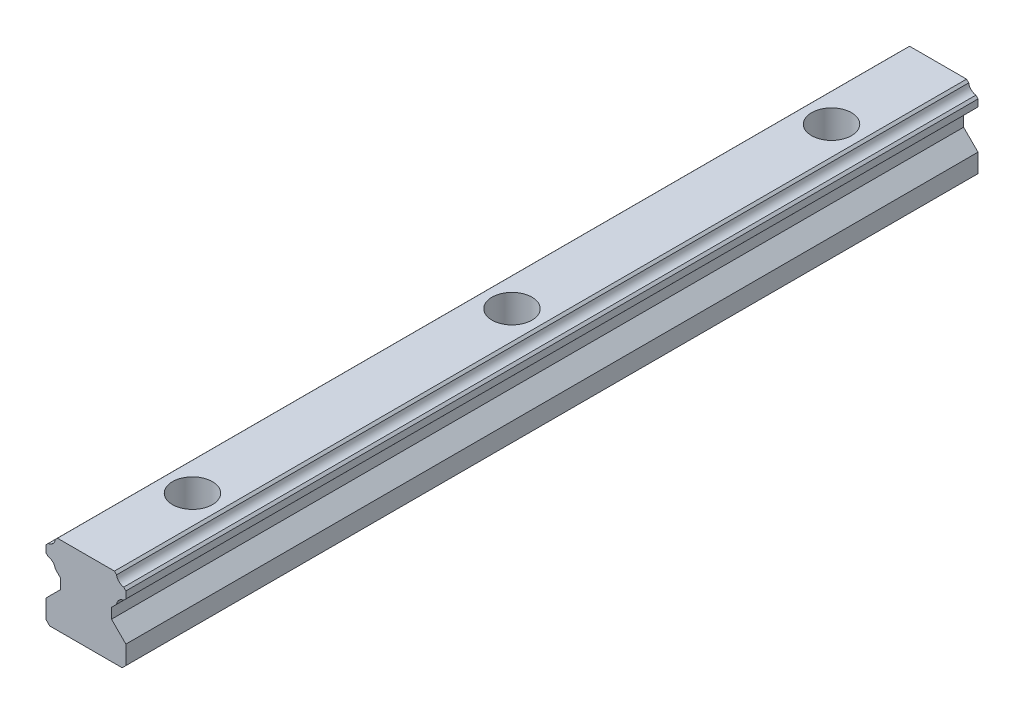
ISO-10303-21;
HEADER;
FILE_DESCRIPTION(('STEP AP214'),'2;1');
FILE_NAME('part.step','',(''),(''),'','','');
FILE_SCHEMA(('AUTOMOTIVE_DESIGN { 1 0 10303 214 1 1 1 1 }'));
ENDSEC;
DATA;
#1=APPLICATION_CONTEXT('core data for automotive mechanical design processes');
#2=APPLICATION_PROTOCOL_DEFINITION('international standard','automotive_design',2000,#1);
#3=PRODUCT_CONTEXT('',#1,'mechanical');
#4=PRODUCT('Part','Part','',(#3));
#5=PRODUCT_RELATED_PRODUCT_CATEGORY('part','',(#4));
#6=PRODUCT_DEFINITION_FORMATION('','',#4);
#7=PRODUCT_DEFINITION_CONTEXT('part definition',#1,'design');
#8=PRODUCT_DEFINITION('design','',#6,#7);
#9=PRODUCT_DEFINITION_SHAPE('','',#8);
#10=(LENGTH_UNIT() NAMED_UNIT(*) SI_UNIT(.MILLI.,.METRE.));
#11=(NAMED_UNIT(*) PLANE_ANGLE_UNIT() SI_UNIT($,.RADIAN.));
#12=(NAMED_UNIT(*) SI_UNIT($,.STERADIAN.) SOLID_ANGLE_UNIT());
#13=UNCERTAINTY_MEASURE_WITH_UNIT(LENGTH_MEASURE(1.E-05),#10,'distance_accuracy_value','');
#14=(GEOMETRIC_REPRESENTATION_CONTEXT(3) GLOBAL_UNCERTAINTY_ASSIGNED_CONTEXT((#13)) GLOBAL_UNIT_ASSIGNED_CONTEXT((#10,
#11,#12)) REPRESENTATION_CONTEXT('',''));
#15=CARTESIAN_POINT('',(0.,0.,0.));
#16=DIRECTION('',(0.,0.,1.));
#17=DIRECTION('',(1.,0.,0.));
#18=AXIS2_PLACEMENT_3D('',#15,#16,#17);
#19=CARTESIAN_POINT('',(5.3500197001096,15.,-160.));
#20=DIRECTION('',(0.,1.,0.));
#21=DIRECTION('',(-1.,0.,0.));
#22=AXIS2_PLACEMENT_3D('',#19,#20,#21);
#23=PLANE('',#22);
#24=CARTESIAN_POINT('',(0.,15.,-80.));
#25=DIRECTION('',(0.,1.,0.));
#26=DIRECTION('',(0.,0.,1.));
#27=AXIS2_PLACEMENT_3D('',#24,#25,#26);
#28=CIRCLE('',#27,3.75000000000001);
#29=CARTESIAN_POINT('',(0.,15.,-76.25));
#30=VERTEX_POINT('',#29);
#31=EDGE_CURVE('E481',#30,#30,#28,.T.);
#32=ORIENTED_EDGE('',*,*,#31,.F.);
#33=EDGE_LOOP('',(#32));
#34=FACE_BOUND('',#33,.T.);
#35=DIRECTION('',(-1.,0.,0.));
#36=VECTOR('',#35,1.);
#37=CARTESIAN_POINT('',(5.3500197001096,15.,0.));
#38=LINE('',#37,#36);
#39=CARTESIAN_POINT('',(5.3500197001096,15.,0.));
#40=VERTEX_POINT('',#39);
#41=CARTESIAN_POINT('',(-5.3500197001096,15.,0.));
#42=VERTEX_POINT('',#41);
#43=EDGE_CURVE('E272',#40,#42,#38,.T.);
#44=ORIENTED_EDGE('',*,*,#43,.F.);
#45=DIRECTION('',(0.,0.,1.));
#46=VECTOR('',#45,1.);
#47=CARTESIAN_POINT('',(5.3500197001096,15.,-160.));
#48=LINE('',#47,#46);
#49=CARTESIAN_POINT('',(5.3500197001096,15.,-160.));
#50=VERTEX_POINT('',#49);
#51=EDGE_CURVE('E314',#50,#40,#48,.T.);
#52=ORIENTED_EDGE('',*,*,#51,.F.);
#53=DIRECTION('',(-1.,0.,0.));
#54=VECTOR('',#53,1.);
#55=CARTESIAN_POINT('',(5.3500197001096,15.,-160.));
#56=LINE('',#55,#54);
#57=CARTESIAN_POINT('',(-5.3500197001096,15.,-160.));
#58=VERTEX_POINT('',#57);
#59=EDGE_CURVE('E534',#50,#58,#56,.T.);
#60=ORIENTED_EDGE('',*,*,#59,.T.);
#61=DIRECTION('',(0.,0.,1.));
#62=VECTOR('',#61,1.);
#63=CARTESIAN_POINT('',(-5.3500197001096,15.,-160.));
#64=LINE('',#63,#62);
#65=EDGE_CURVE('E312',#58,#42,#64,.T.);
#66=ORIENTED_EDGE('',*,*,#65,.T.);
#67=EDGE_LOOP('',(#44,#52,#60,#66));
#68=FACE_BOUND('',#67,.T.);
#69=CARTESIAN_POINT('',(0.,15.,-20.));
#70=DIRECTION('',(0.,1.,0.));
#71=DIRECTION('',(0.,0.,1.));
#72=AXIS2_PLACEMENT_3D('',#69,#70,#71);
#73=CIRCLE('',#72,3.75000000000001);
#74=CARTESIAN_POINT('',(0.,15.,-16.25));
#75=VERTEX_POINT('',#74);
#76=EDGE_CURVE('E233',#75,#75,#73,.T.);
#77=ORIENTED_EDGE('',*,*,#76,.F.);
#78=EDGE_LOOP('',(#77));
#79=FACE_BOUND('',#78,.T.);
#80=CARTESIAN_POINT('',(0.,15.,-140.));
#81=DIRECTION('',(0.,1.,0.));
#82=DIRECTION('',(0.,0.,1.));
#83=AXIS2_PLACEMENT_3D('',#80,#81,#82);
#84=CIRCLE('',#83,3.75000000000001);
#85=CARTESIAN_POINT('',(0.,15.,-136.25));
#86=VERTEX_POINT('',#85);
#87=EDGE_CURVE('E469',#86,#86,#84,.T.);
#88=ORIENTED_EDGE('',*,*,#87,.F.);
#89=EDGE_LOOP('',(#88));
#90=FACE_BOUND('',#89,.T.);
#91=ADVANCED_FACE('F35',(#34,#68,#79,#90),#23,.T.);
#92=CARTESIAN_POINT('',(-6.8000072137317,0.,-160.));
#93=DIRECTION('',(0.,-1.,0.));
#94=DIRECTION('',(1.,0.,0.));
#95=AXIS2_PLACEMENT_3D('',#92,#93,#94);
#96=PLANE('',#95);
#97=CARTESIAN_POINT('',(0.,0.,-80.));
#98=DIRECTION('',(0.,1.,0.));
#99=DIRECTION('',(0.,0.,1.));
#100=AXIS2_PLACEMENT_3D('',#97,#98,#99);
#101=CIRCLE('',#100,2.25);
#102=CARTESIAN_POINT('',(0.,0.,-77.75));
#103=VERTEX_POINT('',#102);
#104=EDGE_CURVE('E472',#103,#103,#101,.T.);
#105=ORIENTED_EDGE('',*,*,#104,.T.);
#106=EDGE_LOOP('',(#105));
#107=FACE_BOUND('',#106,.T.);
#108=DIRECTION('',(1.,0.,0.));
#109=VECTOR('',#108,1.);
#110=CARTESIAN_POINT('',(-6.8000072137317,0.,0.));
#111=LINE('',#110,#109);
#112=CARTESIAN_POINT('',(-6.8000072137317,0.,0.));
#113=VERTEX_POINT('',#112);
#114=CARTESIAN_POINT('',(6.8000072137317,0.,0.));
#115=VERTEX_POINT('',#114);
#116=EDGE_CURVE('E236',#113,#115,#111,.T.);
#117=ORIENTED_EDGE('',*,*,#116,.F.);
#118=DIRECTION('',(0.,0.,1.));
#119=VECTOR('',#118,1.);
#120=CARTESIAN_POINT('',(-6.8000072137317,0.,-160.));
#121=LINE('',#120,#119);
#122=CARTESIAN_POINT('',(-6.8000072137317,0.,-160.));
#123=VERTEX_POINT('',#122);
#124=EDGE_CURVE('E337',#123,#113,#121,.T.);
#125=ORIENTED_EDGE('',*,*,#124,.F.);
#126=DIRECTION('',(1.,0.,0.));
#127=VECTOR('',#126,1.);
#128=CARTESIAN_POINT('',(-6.8000072137317,0.,-160.));
#129=LINE('',#128,#127);
#130=CARTESIAN_POINT('',(6.8000072137317,0.,-160.));
#131=VERTEX_POINT('',#130);
#132=EDGE_CURVE('E498',#123,#131,#129,.T.);
#133=ORIENTED_EDGE('',*,*,#132,.T.);
#134=DIRECTION('',(0.,0.,1.));
#135=VECTOR('',#134,1.);
#136=CARTESIAN_POINT('',(6.8000072137317,0.,-160.));
#137=LINE('',#136,#135);
#138=EDGE_CURVE('E336',#131,#115,#137,.T.);
#139=ORIENTED_EDGE('',*,*,#138,.T.);
#140=EDGE_LOOP('',(#117,#125,#133,#139));
#141=FACE_BOUND('',#140,.T.);
#142=CARTESIAN_POINT('',(0.,0.,-20.));
#143=DIRECTION('',(0.,1.,0.));
#144=DIRECTION('',(0.,0.,1.));
#145=AXIS2_PLACEMENT_3D('',#142,#143,#144);
#146=CIRCLE('',#145,2.25);
#147=CARTESIAN_POINT('',(0.,0.,-17.75));
#148=VERTEX_POINT('',#147);
#149=EDGE_CURVE('E484',#148,#148,#146,.T.);
#150=ORIENTED_EDGE('',*,*,#149,.T.);
#151=EDGE_LOOP('',(#150));
#152=FACE_BOUND('',#151,.T.);
#153=CARTESIAN_POINT('',(0.,0.,-140.));
#154=DIRECTION('',(0.,1.,0.));
#155=DIRECTION('',(0.,0.,1.));
#156=AXIS2_PLACEMENT_3D('',#153,#154,#155);
#157=CIRCLE('',#156,2.25);
#158=CARTESIAN_POINT('',(0.,0.,-137.75));
#159=VERTEX_POINT('',#158);
#160=EDGE_CURVE('E461',#159,#159,#157,.T.);
#161=ORIENTED_EDGE('',*,*,#160,.T.);
#162=EDGE_LOOP('',(#161));
#163=FACE_BOUND('',#162,.T.);
#164=ADVANCED_FACE('F350',(#107,#141,#152,#163),#96,.T.);
#165=CARTESIAN_POINT('',(-7.5,4.2000245999998,-160.));
#166=DIRECTION('',(-1.,0.,0.));
#167=DIRECTION('',(0.,0.,1.));
#168=AXIS2_PLACEMENT_3D('',#165,#166,#167);
#169=PLANE('',#168);
#170=DIRECTION('',(0.,-1.,0.));
#171=VECTOR('',#170,1.);
#172=CARTESIAN_POINT('',(-7.5,4.2000245999998,0.));
#173=LINE('',#172,#171);
#174=CARTESIAN_POINT('',(-7.5,4.2000245999998,0.));
#175=VERTEX_POINT('',#174);
#176=CARTESIAN_POINT('',(-7.5,0.699992710002539,0.));
#177=VERTEX_POINT('',#176);
#178=EDGE_CURVE('E229',#175,#177,#173,.T.);
#179=ORIENTED_EDGE('',*,*,#178,.F.);
#180=DIRECTION('',(0.,0.,1.));
#181=VECTOR('',#180,1.);
#182=CARTESIAN_POINT('',(-7.5,4.2000245999998,-160.));
#183=LINE('',#182,#181);
#184=CARTESIAN_POINT('',(-7.5,4.2000245999998,-160.));
#185=VERTEX_POINT('',#184);
#186=EDGE_CURVE('E11',#185,#175,#183,.T.);
#187=ORIENTED_EDGE('',*,*,#186,.F.);
#188=DIRECTION('',(0.,-1.,0.));
#189=VECTOR('',#188,1.);
#190=CARTESIAN_POINT('',(-7.5,4.2000245999998,-160.));
#191=LINE('',#190,#189);
#192=CARTESIAN_POINT('',(-7.5,0.699992710002539,-160.));
#193=VERTEX_POINT('',#192);
#194=EDGE_CURVE('E298',#185,#193,#191,.T.);
#195=ORIENTED_EDGE('',*,*,#194,.T.);
#196=DIRECTION('',(0.,0.,1.));
#197=VECTOR('',#196,1.);
#198=CARTESIAN_POINT('',(-7.5,0.699992710002539,-160.));
#199=LINE('',#198,#197);
#200=EDGE_CURVE('E39',#193,#177,#199,.T.);
#201=ORIENTED_EDGE('',*,*,#200,.T.);
#202=EDGE_LOOP('',(#179,#187,#195,#201));
#203=FACE_BOUND('',#202,.T.);
#204=ADVANCED_FACE('F37',(#203),#169,.T.);
#205=CARTESIAN_POINT('',(-4.8000182999995,6.9000063000003,-160.));
#206=DIRECTION('',(-0.707106781186548,0.707106781186548,0.));
#207=DIRECTION('',(-0.707106781186548,-0.707106781186548,0.));
#208=AXIS2_PLACEMENT_3D('',#205,#206,#207);
#209=PLANE('',#208);
#210=DIRECTION('',(-0.707106781186548,-0.707106781186548,0.));
#211=VECTOR('',#210,1.);
#212=CARTESIAN_POINT('',(-4.8000182999995,6.9000063000003,0.));
#213=LINE('',#212,#211);
#214=CARTESIAN_POINT('',(-4.8000182999995,6.9000063000003,0.));
#215=VERTEX_POINT('',#214);
#216=EDGE_CURVE('E296',#215,#175,#213,.T.);
#217=ORIENTED_EDGE('',*,*,#216,.F.);
#218=DIRECTION('',(0.,0.,1.));
#219=VECTOR('',#218,1.);
#220=CARTESIAN_POINT('',(-4.8000182999995,6.9000063000003,-160.));
#221=LINE('',#220,#219);
#222=CARTESIAN_POINT('',(-4.8000182999995,6.9000063000003,-160.));
#223=VERTEX_POINT('',#222);
#224=EDGE_CURVE('E45',#223,#215,#221,.T.);
#225=ORIENTED_EDGE('',*,*,#224,.F.);
#226=DIRECTION('',(-0.707106781186548,-0.707106781186548,0.));
#227=VECTOR('',#226,1.);
#228=CARTESIAN_POINT('',(-4.8000182999995,6.9000063000003,-160.));
#229=LINE('',#228,#227);
#230=EDGE_CURVE('E219',#223,#185,#229,.T.);
#231=ORIENTED_EDGE('',*,*,#230,.T.);
#232=ORIENTED_EDGE('',*,*,#186,.T.);
#233=EDGE_LOOP('',(#217,#225,#231,#232));
#234=FACE_BOUND('',#233,.T.);
#235=ADVANCED_FACE('F342',(#234),#209,.T.);
#236=CARTESIAN_POINT('',(-4.8000182999995,8.8400053999999,-160.));
#237=DIRECTION('',(-1.,0.,0.));
#238=DIRECTION('',(0.,0.,1.));
#239=AXIS2_PLACEMENT_3D('',#236,#237,#238);
#240=PLANE('',#239);
#241=DIRECTION('',(0.,-1.,0.));
#242=VECTOR('',#241,1.);
#243=CARTESIAN_POINT('',(-4.8000182999995,8.8400053999999,0.));
#244=LINE('',#243,#242);
#245=CARTESIAN_POINT('',(-4.8000182999995,8.8400053999999,0.));
#246=VERTEX_POINT('',#245);
#247=EDGE_CURVE('E206',#246,#215,#244,.T.);
#248=ORIENTED_EDGE('',*,*,#247,.F.);
#249=DIRECTION('',(0.,0.,1.));
#250=VECTOR('',#249,1.);
#251=CARTESIAN_POINT('',(-4.8000182999995,8.8400053999999,-160.));
#252=LINE('',#251,#250);
#253=CARTESIAN_POINT('',(-4.8000182999995,8.8400053999999,-160.));
#254=VERTEX_POINT('',#253);
#255=EDGE_CURVE('E201',#254,#246,#252,.T.);
#256=ORIENTED_EDGE('',*,*,#255,.F.);
#257=DIRECTION('',(0.,-1.,0.));
#258=VECTOR('',#257,1.);
#259=CARTESIAN_POINT('',(-4.8000182999995,8.8400053999999,-160.));
#260=LINE('',#259,#258);
#261=EDGE_CURVE('E204',#254,#223,#260,.T.);
#262=ORIENTED_EDGE('',*,*,#261,.T.);
#263=ORIENTED_EDGE('',*,*,#224,.T.);
#264=EDGE_LOOP('',(#248,#256,#262,#263));
#265=FACE_BOUND('',#264,.T.);
#266=ADVANCED_FACE('F203',(#265),#240,.T.);
#267=CARTESIAN_POINT('',(-5.7559468125191,9.794179117755,-160.));
#268=DIRECTION('',(-0.706456870044271,-0.707756095535215,0.));
#269=DIRECTION('',(0.707756095535215,-0.706456870044271,0.));
#270=AXIS2_PLACEMENT_3D('',#267,#268,#269);
#271=PLANE('',#270);
#272=DIRECTION('',(0.707756095535215,-0.706456870044271,0.));
#273=VECTOR('',#272,1.);
#274=CARTESIAN_POINT('',(-5.7559468125191,9.794179117755,0.));
#275=LINE('',#274,#273);
#276=CARTESIAN_POINT('',(-5.7559468125191,9.794179117755,0.));
#277=VERTEX_POINT('',#276);
#278=EDGE_CURVE('E293',#277,#246,#275,.T.);
#279=ORIENTED_EDGE('',*,*,#278,.F.);
#280=DIRECTION('',(0.,0.,1.));
#281=VECTOR('',#280,1.);
#282=CARTESIAN_POINT('',(-5.7559468125191,9.794179117755,-160.));
#283=LINE('',#282,#281);
#284=CARTESIAN_POINT('',(-5.7559468125191,9.794179117755,-160.));
#285=VERTEX_POINT('',#284);
#286=EDGE_CURVE('E211',#285,#277,#283,.T.);
#287=ORIENTED_EDGE('',*,*,#286,.F.);
#288=DIRECTION('',(0.707756095535215,-0.706456870044271,0.));
#289=VECTOR('',#288,1.);
#290=CARTESIAN_POINT('',(-5.7559468125191,9.794179117755,-160.));
#291=LINE('',#290,#289);
#292=EDGE_CURVE('E217',#285,#254,#291,.T.);
#293=ORIENTED_EDGE('',*,*,#292,.T.);
#294=ORIENTED_EDGE('',*,*,#255,.T.);
#295=EDGE_LOOP('',(#279,#287,#293,#294));
#296=FACE_BOUND('',#295,.T.);
#297=ADVANCED_FACE('F221',(#296),#271,.T.);
#298=CARTESIAN_POINT('',(-7.30229328109914,9.58823668135776,-160.));
#299=DIRECTION('',(0.,0.,1.));
#300=DIRECTION('',(1.,0.,0.));
#301=AXIS2_PLACEMENT_3D('',#298,#299,#300);
#302=CYLINDRICAL_SURFACE('',#301,1.55999989999974);
#303=CARTESIAN_POINT('',(-7.30229328109914,9.58823668135776,0.));
#304=DIRECTION('',(0.,0.,-1.));
#305=DIRECTION('',(-1.,0.,0.));
#306=AXIS2_PLACEMENT_3D('',#303,#304,#305);
#307=CIRCLE('',#306,1.55999989999974);
#308=CARTESIAN_POINT('',(-7.0943256899454,11.134312089942,0.));
#309=VERTEX_POINT('',#308);
#310=EDGE_CURVE('E290',#309,#277,#307,.T.);
#311=ORIENTED_EDGE('',*,*,#310,.F.);
#312=DIRECTION('',(0.,0.,1.));
#313=VECTOR('',#312,1.);
#314=CARTESIAN_POINT('',(-7.0943256899454,11.134312089942,-160.));
#315=LINE('',#314,#313);
#316=CARTESIAN_POINT('',(-7.0943256899454,11.134312089942,-160.));
#317=VERTEX_POINT('',#316);
#318=EDGE_CURVE('E302',#317,#309,#315,.T.);
#319=ORIENTED_EDGE('',*,*,#318,.F.);
#320=CARTESIAN_POINT('',(-7.30229328109914,9.58823668135776,-160.));
#321=DIRECTION('',(0.,0.,-1.));
#322=DIRECTION('',(-1.,0.,0.));
#323=AXIS2_PLACEMENT_3D('',#320,#321,#322);
#324=CIRCLE('',#323,1.55999989999974);
#325=EDGE_CURVE('E222',#317,#285,#324,.T.);
#326=ORIENTED_EDGE('',*,*,#325,.T.);
#327=ORIENTED_EDGE('',*,*,#286,.T.);
#328=EDGE_LOOP('',(#311,#319,#326,#327));
#329=FACE_BOUND('',#328,.T.);
#330=ADVANCED_FACE('F598',(#329),#302,.F.);
#331=CARTESIAN_POINT('',(-7.5,11.539986599989,-160.));
#332=DIRECTION('',(-0.707106955483918,-0.707106606889134,0.));
#333=DIRECTION('',(0.707106606889134,-0.707106955483918,0.));
#334=AXIS2_PLACEMENT_3D('',#331,#332,#333);
#335=PLANE('',#334);
#336=DIRECTION('',(0.707106606889134,-0.707106955483918,0.));
#337=VECTOR('',#336,1.);
#338=CARTESIAN_POINT('',(-7.5,11.539986599989,0.));
#339=LINE('',#338,#337);
#340=CARTESIAN_POINT('',(-7.5,11.539986599989,0.));
#341=VERTEX_POINT('',#340);
#342=EDGE_CURVE('E287',#341,#309,#339,.T.);
#343=ORIENTED_EDGE('',*,*,#342,.F.);
#344=DIRECTION('',(0.,0.,1.));
#345=VECTOR('',#344,1.);
#346=CARTESIAN_POINT('',(-7.5,11.539986599989,-160.));
#347=LINE('',#346,#345);
#348=CARTESIAN_POINT('',(-7.5,11.539986599989,-160.));
#349=VERTEX_POINT('',#348);
#350=EDGE_CURVE('E304',#349,#341,#347,.T.);
#351=ORIENTED_EDGE('',*,*,#350,.F.);
#352=DIRECTION('',(0.707106606889134,-0.707106955483918,0.));
#353=VECTOR('',#352,1.);
#354=CARTESIAN_POINT('',(-7.5,11.539986599989,-160.));
#355=LINE('',#354,#353);
#356=EDGE_CURVE('E224',#349,#317,#355,.T.);
#357=ORIENTED_EDGE('',*,*,#356,.T.);
#358=ORIENTED_EDGE('',*,*,#318,.T.);
#359=EDGE_LOOP('',(#343,#351,#357,#358));
#360=FACE_BOUND('',#359,.T.);
#361=ADVANCED_FACE('F552',(#360),#335,.T.);
#362=CARTESIAN_POINT('',(-7.5,12.850020399955,-160.));
#363=DIRECTION('',(-1.,0.,0.));
#364=DIRECTION('',(0.,0.,1.));
#365=AXIS2_PLACEMENT_3D('',#362,#363,#364);
#366=PLANE('',#365);
#367=DIRECTION('',(0.,-1.,0.));
#368=VECTOR('',#367,1.);
#369=CARTESIAN_POINT('',(-7.5,12.850020399955,0.));
#370=LINE('',#369,#368);
#371=CARTESIAN_POINT('',(-7.5,12.850020399955,0.));
#372=VERTEX_POINT('',#371);
#373=EDGE_CURVE('E284',#372,#341,#370,.T.);
#374=ORIENTED_EDGE('',*,*,#373,.F.);
#375=DIRECTION('',(0.,0.,1.));
#376=VECTOR('',#375,1.);
#377=CARTESIAN_POINT('',(-7.5,12.850020399955,-160.));
#378=LINE('',#377,#376);
#379=CARTESIAN_POINT('',(-7.5,12.850020399955,-160.));
#380=VERTEX_POINT('',#379);
#381=EDGE_CURVE('E306',#380,#372,#378,.T.);
#382=ORIENTED_EDGE('',*,*,#381,.F.);
#383=DIRECTION('',(0.,-1.,0.));
#384=VECTOR('',#383,1.);
#385=CARTESIAN_POINT('',(-7.5,12.850020399955,-160.));
#386=LINE('',#385,#384);
#387=EDGE_CURVE('E546',#380,#349,#386,.T.);
#388=ORIENTED_EDGE('',*,*,#387,.T.);
#389=ORIENTED_EDGE('',*,*,#350,.T.);
#390=EDGE_LOOP('',(#374,#382,#388,#389));
#391=FACE_BOUND('',#390,.T.);
#392=ADVANCED_FACE('F558',(#391),#366,.T.);
#393=CARTESIAN_POINT('',(-7.0943256899454,13.268442750921,-160.));
#394=DIRECTION('',(-0.717959196634107,0.696085190166051,0.));
#395=DIRECTION('',(-0.696085190166051,-0.717959196634107,0.));
#396=AXIS2_PLACEMENT_3D('',#393,#394,#395);
#397=PLANE('',#396);
#398=DIRECTION('',(-0.696085190166051,-0.717959196634107,0.));
#399=VECTOR('',#398,1.);
#400=CARTESIAN_POINT('',(-7.0943256899454,13.268442750921,0.));
#401=LINE('',#400,#399);
#402=CARTESIAN_POINT('',(-7.0943256899454,13.268442750921,0.));
#403=VERTEX_POINT('',#402);
#404=EDGE_CURVE('E281',#403,#372,#401,.T.);
#405=ORIENTED_EDGE('',*,*,#404,.F.);
#406=DIRECTION('',(0.,0.,1.));
#407=VECTOR('',#406,1.);
#408=CARTESIAN_POINT('',(-7.0943256899454,13.268442750921,-160.));
#409=LINE('',#408,#407);
#410=CARTESIAN_POINT('',(-7.0943256899454,13.268442750921,-160.));
#411=VERTEX_POINT('',#410);
#412=EDGE_CURVE('E308',#411,#403,#409,.T.);
#413=ORIENTED_EDGE('',*,*,#412,.F.);
#414=DIRECTION('',(-0.696085190166051,-0.717959196634107,0.));
#415=VECTOR('',#414,1.);
#416=CARTESIAN_POINT('',(-7.0943256899454,13.268442750921,-160.));
#417=LINE('',#416,#415);
#418=EDGE_CURVE('E543',#411,#380,#417,.T.);
#419=ORIENTED_EDGE('',*,*,#418,.T.);
#420=ORIENTED_EDGE('',*,*,#381,.T.);
#421=EDGE_LOOP('',(#405,#413,#419,#420));
#422=FACE_BOUND('',#421,.T.);
#423=ADVANCED_FACE('F561',(#422),#397,.T.);
#424=CARTESIAN_POINT('',(-7.30025219070474,14.8147913417259,-160.));
#425=DIRECTION('',(0.,0.,1.));
#426=DIRECTION('',(1.,0.,0.));
#427=AXIS2_PLACEMENT_3D('',#424,#425,#426);
#428=CYLINDRICAL_SURFACE('',#427,1.55999989999974);
#429=CARTESIAN_POINT('',(-7.30025219070474,14.8147913417259,0.));
#430=DIRECTION('',(0.,0.,-1.));
#431=DIRECTION('',(-1.,0.,0.));
#432=AXIS2_PLACEMENT_3D('',#429,#430,#431);
#433=CIRCLE('',#432,1.55999989999974);
#434=CARTESIAN_POINT('',(-5.7559468125191,14.594063937659,0.));
#435=VERTEX_POINT('',#434);
#436=EDGE_CURVE('E278',#435,#403,#433,.T.);
#437=ORIENTED_EDGE('',*,*,#436,.F.);
#438=DIRECTION('',(0.,0.,1.));
#439=VECTOR('',#438,1.);
#440=CARTESIAN_POINT('',(-5.7559468125191,14.594063937659,-160.));
#441=LINE('',#440,#439);
#442=CARTESIAN_POINT('',(-5.7559468125191,14.594063937659,-160.));
#443=VERTEX_POINT('',#442);
#444=EDGE_CURVE('E310',#443,#435,#441,.T.);
#445=ORIENTED_EDGE('',*,*,#444,.F.);
#446=CARTESIAN_POINT('',(-7.30025219070474,14.8147913417259,-160.));
#447=DIRECTION('',(0.,0.,-1.));
#448=DIRECTION('',(-1.,0.,0.));
#449=AXIS2_PLACEMENT_3D('',#446,#447,#448);
#450=CIRCLE('',#449,1.55999989999974);
#451=EDGE_CURVE('E540',#443,#411,#450,.T.);
#452=ORIENTED_EDGE('',*,*,#451,.T.);
#453=ORIENTED_EDGE('',*,*,#412,.T.);
#454=EDGE_LOOP('',(#437,#445,#452,#453));
#455=FACE_BOUND('',#454,.T.);
#456=ADVANCED_FACE('F566',(#455),#428,.F.);
#457=CARTESIAN_POINT('',(-5.3500197001096,15.,-160.));
#458=DIRECTION('',(-0.70711457624681,0.707098986040352,0.));
#459=DIRECTION('',(-0.707098986040352,-0.70711457624681,0.));
#460=AXIS2_PLACEMENT_3D('',#457,#458,#459);
#461=PLANE('',#460);
#462=DIRECTION('',(-0.707098986040352,-0.70711457624681,0.));
#463=VECTOR('',#462,1.);
#464=CARTESIAN_POINT('',(-5.3500197001096,15.,0.));
#465=LINE('',#464,#463);
#466=EDGE_CURVE('E275',#42,#435,#465,.T.);
#467=ORIENTED_EDGE('',*,*,#466,.F.);
#468=ORIENTED_EDGE('',*,*,#65,.F.);
#469=DIRECTION('',(-0.707098986040352,-0.70711457624681,0.));
#470=VECTOR('',#469,1.);
#471=CARTESIAN_POINT('',(-5.3500197001096,15.,-160.));
#472=LINE('',#471,#470);
#473=EDGE_CURVE('E537',#58,#443,#472,.T.);
#474=ORIENTED_EDGE('',*,*,#473,.T.);
#475=ORIENTED_EDGE('',*,*,#444,.T.);
#476=EDGE_LOOP('',(#467,#468,#474,#475));
#477=FACE_BOUND('',#476,.T.);
#478=ADVANCED_FACE('F364',(#477),#461,.T.);
#479=CARTESIAN_POINT('',(5.3500197001096,15.,-160.));
#480=DIRECTION('',(0.707114576246815,0.707098986040348,0.));
#481=DIRECTION('',(-0.707098986040348,0.707114576246815,0.));
#482=AXIS2_PLACEMENT_3D('',#479,#480,#481);
#483=PLANE('',#482);
#484=DIRECTION('',(-0.707098986040348,0.707114576246815,0.));
#485=VECTOR('',#484,1.);
#486=CARTESIAN_POINT('',(5.3500197001096,15.,0.));
#487=LINE('',#486,#485);
#488=CARTESIAN_POINT('',(5.75594681251909,14.594063937659,0.));
#489=VERTEX_POINT('',#488);
#490=EDGE_CURVE('E269',#489,#40,#487,.T.);
#491=ORIENTED_EDGE('',*,*,#490,.F.);
#492=DIRECTION('',(0.,0.,1.));
#493=VECTOR('',#492,1.);
#494=CARTESIAN_POINT('',(5.75594681251909,14.594063937659,-160.));
#495=LINE('',#494,#493);
#496=CARTESIAN_POINT('',(5.75594681251909,14.594063937659,-160.));
#497=VERTEX_POINT('',#496);
#498=EDGE_CURVE('E316',#497,#489,#495,.T.);
#499=ORIENTED_EDGE('',*,*,#498,.F.);
#500=DIRECTION('',(-0.707098986040348,0.707114576246815,0.));
#501=VECTOR('',#500,1.);
#502=CARTESIAN_POINT('',(5.3500197001096,15.,-160.));
#503=LINE('',#502,#501);
#504=EDGE_CURVE('E531',#497,#50,#503,.T.);
#505=ORIENTED_EDGE('',*,*,#504,.T.);
#506=ORIENTED_EDGE('',*,*,#51,.T.);
#507=EDGE_LOOP('',(#491,#499,#505,#506));
#508=FACE_BOUND('',#507,.T.);
#509=ADVANCED_FACE('F366',(#508),#483,.T.);
#510=CARTESIAN_POINT('',(7.30025219070473,14.8147913417259,-160.));
#511=DIRECTION('',(0.,0.,1.));
#512=DIRECTION('',(1.,0.,0.));
#513=AXIS2_PLACEMENT_3D('',#510,#511,#512);
#514=CYLINDRICAL_SURFACE('',#513,1.55999989999974);
#515=CARTESIAN_POINT('',(7.30025219070473,14.8147913417259,0.));
#516=DIRECTION('',(0.,0.,-1.));
#517=DIRECTION('',(1.,0.,0.));
#518=AXIS2_PLACEMENT_3D('',#515,#516,#517);
#519=CIRCLE('',#518,1.55999989999974);
#520=CARTESIAN_POINT('',(7.09432568994539,13.268442750921,0.));
#521=VERTEX_POINT('',#520);
#522=EDGE_CURVE('E266',#521,#489,#519,.T.);
#523=ORIENTED_EDGE('',*,*,#522,.F.);
#524=DIRECTION('',(0.,0.,1.));
#525=VECTOR('',#524,1.);
#526=CARTESIAN_POINT('',(7.09432568994539,13.268442750921,-160.));
#527=LINE('',#526,#525);
#528=CARTESIAN_POINT('',(7.09432568994539,13.268442750921,-160.));
#529=VERTEX_POINT('',#528);
#530=EDGE_CURVE('E318',#529,#521,#527,.T.);
#531=ORIENTED_EDGE('',*,*,#530,.F.);
#532=CARTESIAN_POINT('',(7.30025219070473,14.8147913417259,-160.));
#533=DIRECTION('',(0.,0.,-1.));
#534=DIRECTION('',(1.,0.,0.));
#535=AXIS2_PLACEMENT_3D('',#532,#533,#534);
#536=CIRCLE('',#535,1.55999989999974);
#537=EDGE_CURVE('E528',#529,#497,#536,.T.);
#538=ORIENTED_EDGE('',*,*,#537,.T.);
#539=ORIENTED_EDGE('',*,*,#498,.T.);
#540=EDGE_LOOP('',(#523,#531,#538,#539));
#541=FACE_BOUND('',#540,.T.);
#542=ADVANCED_FACE('F369',(#541),#514,.F.);
#543=CARTESIAN_POINT('',(7.09432568994539,13.268442750921,-160.));
#544=DIRECTION('',(0.717959196634104,0.696085190166054,0.));
#545=DIRECTION('',(-0.696085190166054,0.717959196634104,0.));
#546=AXIS2_PLACEMENT_3D('',#543,#544,#545);
#547=PLANE('',#546);
#548=DIRECTION('',(-0.696085190166054,0.717959196634104,0.));
#549=VECTOR('',#548,1.);
#550=CARTESIAN_POINT('',(7.09432568994539,13.268442750921,0.));
#551=LINE('',#550,#549);
#552=CARTESIAN_POINT('',(7.5,12.850020399955,0.));
#553=VERTEX_POINT('',#552);
#554=EDGE_CURVE('E263',#553,#521,#551,.T.);
#555=ORIENTED_EDGE('',*,*,#554,.F.);
#556=DIRECTION('',(0.,0.,1.));
#557=VECTOR('',#556,1.);
#558=CARTESIAN_POINT('',(7.5,12.850020399955,-160.));
#559=LINE('',#558,#557);
#560=CARTESIAN_POINT('',(7.5,12.850020399955,-160.));
#561=VERTEX_POINT('',#560);
#562=EDGE_CURVE('E320',#561,#553,#559,.T.);
#563=ORIENTED_EDGE('',*,*,#562,.F.);
#564=DIRECTION('',(-0.696085190166054,0.717959196634104,0.));
#565=VECTOR('',#564,1.);
#566=CARTESIAN_POINT('',(7.09432568994539,13.268442750921,-160.));
#567=LINE('',#566,#565);
#568=EDGE_CURVE('E525',#561,#529,#567,.T.);
#569=ORIENTED_EDGE('',*,*,#568,.T.);
#570=ORIENTED_EDGE('',*,*,#530,.T.);
#571=EDGE_LOOP('',(#555,#563,#569,#570));
#572=FACE_BOUND('',#571,.T.);
#573=ADVANCED_FACE('F373',(#572),#547,.T.);
#574=CARTESIAN_POINT('',(7.5,12.850020399955,-160.));
#575=DIRECTION('',(1.,0.,0.));
#576=DIRECTION('',(0.,0.,-1.));
#577=AXIS2_PLACEMENT_3D('',#574,#575,#576);
#578=PLANE('',#577);
#579=DIRECTION('',(0.,1.,0.));
#580=VECTOR('',#579,1.);
#581=CARTESIAN_POINT('',(7.5,12.850020399955,0.));
#582=LINE('',#581,#580);
#583=CARTESIAN_POINT('',(7.5,11.539986599989,0.));
#584=VERTEX_POINT('',#583);
#585=EDGE_CURVE('E260',#584,#553,#582,.T.);
#586=ORIENTED_EDGE('',*,*,#585,.F.);
#587=DIRECTION('',(0.,0.,1.));
#588=VECTOR('',#587,1.);
#589=CARTESIAN_POINT('',(7.5,11.539986599989,-160.));
#590=LINE('',#589,#588);
#591=CARTESIAN_POINT('',(7.5,11.539986599989,-160.));
#592=VERTEX_POINT('',#591);
#593=EDGE_CURVE('E322',#592,#584,#590,.T.);
#594=ORIENTED_EDGE('',*,*,#593,.F.);
#595=DIRECTION('',(0.,1.,0.));
#596=VECTOR('',#595,1.);
#597=CARTESIAN_POINT('',(7.5,12.850020399955,-160.));
#598=LINE('',#597,#596);
#599=EDGE_CURVE('E522',#592,#561,#598,.T.);
#600=ORIENTED_EDGE('',*,*,#599,.T.);
#601=ORIENTED_EDGE('',*,*,#562,.T.);
#602=EDGE_LOOP('',(#586,#594,#600,#601));
#603=FACE_BOUND('',#602,.T.);
#604=ADVANCED_FACE('F377',(#603),#578,.T.);
#605=CARTESIAN_POINT('',(7.5,11.539986599989,-160.));
#606=DIRECTION('',(0.707106955483915,-0.707106606889138,0.));
#607=DIRECTION('',(0.707106606889138,0.707106955483915,0.));
#608=AXIS2_PLACEMENT_3D('',#605,#606,#607);
#609=PLANE('',#608);
#610=DIRECTION('',(0.707106606889138,0.707106955483915,0.));
#611=VECTOR('',#610,1.);
#612=CARTESIAN_POINT('',(7.5,11.539986599989,0.));
#613=LINE('',#612,#611);
#614=CARTESIAN_POINT('',(7.09432568994539,11.134312089942,0.));
#615=VERTEX_POINT('',#614);
#616=EDGE_CURVE('E257',#615,#584,#613,.T.);
#617=ORIENTED_EDGE('',*,*,#616,.F.);
#618=DIRECTION('',(0.,0.,1.));
#619=VECTOR('',#618,1.);
#620=CARTESIAN_POINT('',(7.09432568994539,11.134312089942,-160.));
#621=LINE('',#620,#619);
#622=CARTESIAN_POINT('',(7.09432568994539,11.134312089942,-160.));
#623=VERTEX_POINT('',#622);
#624=EDGE_CURVE('E324',#623,#615,#621,.T.);
#625=ORIENTED_EDGE('',*,*,#624,.F.);
#626=DIRECTION('',(0.707106606889138,0.707106955483915,0.));
#627=VECTOR('',#626,1.);
#628=CARTESIAN_POINT('',(7.5,11.539986599989,-160.));
#629=LINE('',#628,#627);
#630=EDGE_CURVE('E519',#623,#592,#629,.T.);
#631=ORIENTED_EDGE('',*,*,#630,.T.);
#632=ORIENTED_EDGE('',*,*,#593,.T.);
#633=EDGE_LOOP('',(#617,#625,#631,#632));
#634=FACE_BOUND('',#633,.T.);
#635=ADVANCED_FACE('F381',(#634),#609,.T.);
#636=CARTESIAN_POINT('',(7.30229328109913,9.58823668135777,-160.));
#637=DIRECTION('',(0.,0.,1.));
#638=DIRECTION('',(1.,0.,0.));
#639=AXIS2_PLACEMENT_3D('',#636,#637,#638);
#640=CYLINDRICAL_SURFACE('',#639,1.55999989999974);
#641=CARTESIAN_POINT('',(7.30229328109913,9.58823668135777,0.));
#642=DIRECTION('',(0.,0.,-1.));
#643=DIRECTION('',(1.,0.,0.));
#644=AXIS2_PLACEMENT_3D('',#641,#642,#643);
#645=CIRCLE('',#644,1.55999989999974);
#646=CARTESIAN_POINT('',(5.7559468125191,9.794179117755,0.));
#647=VERTEX_POINT('',#646);
#648=EDGE_CURVE('E254',#647,#615,#645,.T.);
#649=ORIENTED_EDGE('',*,*,#648,.F.);
#650=DIRECTION('',(0.,0.,1.));
#651=VECTOR('',#650,1.);
#652=CARTESIAN_POINT('',(5.7559468125191,9.794179117755,-160.));
#653=LINE('',#652,#651);
#654=CARTESIAN_POINT('',(5.7559468125191,9.794179117755,-160.));
#655=VERTEX_POINT('',#654);
#656=EDGE_CURVE('E326',#655,#647,#653,.T.);
#657=ORIENTED_EDGE('',*,*,#656,.F.);
#658=CARTESIAN_POINT('',(7.30229328109913,9.58823668135777,-160.));
#659=DIRECTION('',(0.,0.,-1.));
#660=DIRECTION('',(1.,0.,0.));
#661=AXIS2_PLACEMENT_3D('',#658,#659,#660);
#662=CIRCLE('',#661,1.55999989999974);
#663=EDGE_CURVE('E516',#655,#623,#662,.T.);
#664=ORIENTED_EDGE('',*,*,#663,.T.);
#665=ORIENTED_EDGE('',*,*,#624,.T.);
#666=EDGE_LOOP('',(#649,#657,#664,#665));
#667=FACE_BOUND('',#666,.T.);
#668=ADVANCED_FACE('F385',(#667),#640,.F.);
#669=CARTESIAN_POINT('',(5.7559468125191,9.794179117755,-160.));
#670=DIRECTION('',(0.706456870044271,-0.707756095535214,0.));
#671=DIRECTION('',(0.707756095535214,0.706456870044271,0.));
#672=AXIS2_PLACEMENT_3D('',#669,#670,#671);
#673=PLANE('',#672);
#674=DIRECTION('',(0.707756095535214,0.706456870044271,0.));
#675=VECTOR('',#674,1.);
#676=CARTESIAN_POINT('',(5.7559468125191,9.794179117755,0.));
#677=LINE('',#676,#675);
#678=CARTESIAN_POINT('',(4.8000182999995,8.8400053999999,0.));
#679=VERTEX_POINT('',#678);
#680=EDGE_CURVE('E251',#679,#647,#677,.T.);
#681=ORIENTED_EDGE('',*,*,#680,.F.);
#682=DIRECTION('',(0.,0.,1.));
#683=VECTOR('',#682,1.);
#684=CARTESIAN_POINT('',(4.8000182999995,8.8400053999999,-160.));
#685=LINE('',#684,#683);
#686=CARTESIAN_POINT('',(4.8000182999995,8.8400053999999,-160.));
#687=VERTEX_POINT('',#686);
#688=EDGE_CURVE('E328',#687,#679,#685,.T.);
#689=ORIENTED_EDGE('',*,*,#688,.F.);
#690=DIRECTION('',(0.707756095535214,0.706456870044271,0.));
#691=VECTOR('',#690,1.);
#692=CARTESIAN_POINT('',(5.7559468125191,9.794179117755,-160.));
#693=LINE('',#692,#691);
#694=EDGE_CURVE('E513',#687,#655,#693,.T.);
#695=ORIENTED_EDGE('',*,*,#694,.T.);
#696=ORIENTED_EDGE('',*,*,#656,.T.);
#697=EDGE_LOOP('',(#681,#689,#695,#696));
#698=FACE_BOUND('',#697,.T.);
#699=ADVANCED_FACE('F389',(#698),#673,.T.);
#700=CARTESIAN_POINT('',(4.8000182999995,8.8400053999999,-160.));
#701=DIRECTION('',(1.,0.,0.));
#702=DIRECTION('',(0.,0.,-1.));
#703=AXIS2_PLACEMENT_3D('',#700,#701,#702);
#704=PLANE('',#703);
#705=DIRECTION('',(0.,1.,0.));
#706=VECTOR('',#705,1.);
#707=CARTESIAN_POINT('',(4.8000182999995,8.8400053999999,0.));
#708=LINE('',#707,#706);
#709=CARTESIAN_POINT('',(4.8000182999995,6.9000063000003,0.));
#710=VERTEX_POINT('',#709);
#711=EDGE_CURVE('E248',#710,#679,#708,.T.);
#712=ORIENTED_EDGE('',*,*,#711,.F.);
#713=DIRECTION('',(0.,0.,1.));
#714=VECTOR('',#713,1.);
#715=CARTESIAN_POINT('',(4.8000182999995,6.9000063000003,-160.));
#716=LINE('',#715,#714);
#717=CARTESIAN_POINT('',(4.8000182999995,6.9000063000003,-160.));
#718=VERTEX_POINT('',#717);
#719=EDGE_CURVE('E330',#718,#710,#716,.T.);
#720=ORIENTED_EDGE('',*,*,#719,.F.);
#721=DIRECTION('',(0.,1.,0.));
#722=VECTOR('',#721,1.);
#723=CARTESIAN_POINT('',(4.8000182999995,8.8400053999999,-160.));
#724=LINE('',#723,#722);
#725=EDGE_CURVE('E510',#718,#687,#724,.T.);
#726=ORIENTED_EDGE('',*,*,#725,.T.);
#727=ORIENTED_EDGE('',*,*,#688,.T.);
#728=EDGE_LOOP('',(#712,#720,#726,#727));
#729=FACE_BOUND('',#728,.T.);
#730=ADVANCED_FACE('F393',(#729),#704,.T.);
#731=CARTESIAN_POINT('',(4.8000182999995,6.9000063000003,-160.));
#732=DIRECTION('',(0.707106781186548,0.707106781186548,0.));
#733=DIRECTION('',(-0.707106781186548,0.707106781186548,0.));
#734=AXIS2_PLACEMENT_3D('',#731,#732,#733);
#735=PLANE('',#734);
#736=DIRECTION('',(-0.707106781186548,0.707106781186548,0.));
#737=VECTOR('',#736,1.);
#738=CARTESIAN_POINT('',(4.8000182999995,6.9000063000003,0.));
#739=LINE('',#738,#737);
#740=CARTESIAN_POINT('',(7.5,4.2000245999998,0.));
#741=VERTEX_POINT('',#740);
#742=EDGE_CURVE('E245',#741,#710,#739,.T.);
#743=ORIENTED_EDGE('',*,*,#742,.F.);
#744=DIRECTION('',(0.,0.,1.));
#745=VECTOR('',#744,1.);
#746=CARTESIAN_POINT('',(7.5,4.2000245999998,-160.));
#747=LINE('',#746,#745);
#748=CARTESIAN_POINT('',(7.5,4.2000245999998,-160.));
#749=VERTEX_POINT('',#748);
#750=EDGE_CURVE('E332',#749,#741,#747,.T.);
#751=ORIENTED_EDGE('',*,*,#750,.F.);
#752=DIRECTION('',(-0.707106781186548,0.707106781186548,0.));
#753=VECTOR('',#752,1.);
#754=CARTESIAN_POINT('',(4.8000182999995,6.9000063000003,-160.));
#755=LINE('',#754,#753);
#756=EDGE_CURVE('E507',#749,#718,#755,.T.);
#757=ORIENTED_EDGE('',*,*,#756,.T.);
#758=ORIENTED_EDGE('',*,*,#719,.T.);
#759=EDGE_LOOP('',(#743,#751,#757,#758));
#760=FACE_BOUND('',#759,.T.);
#761=ADVANCED_FACE('F397',(#760),#735,.T.);
#762=CARTESIAN_POINT('',(7.5,4.2000245999998,-160.));
#763=DIRECTION('',(1.,0.,0.));
#764=DIRECTION('',(0.,1.,0.));
#765=AXIS2_PLACEMENT_3D('',#762,#763,#764);
#766=PLANE('',#765);
#767=DIRECTION('',(0.,1.,0.));
#768=VECTOR('',#767,1.);
#769=CARTESIAN_POINT('',(7.5,4.2000245999998,0.));
#770=LINE('',#769,#768);
#771=CARTESIAN_POINT('',(7.5,0.699992710002543,0.));
#772=VERTEX_POINT('',#771);
#773=EDGE_CURVE('E242',#772,#741,#770,.T.);
#774=ORIENTED_EDGE('',*,*,#773,.F.);
#775=DIRECTION('',(0.,0.,1.));
#776=VECTOR('',#775,1.);
#777=CARTESIAN_POINT('',(7.5,0.699992710002543,-160.));
#778=LINE('',#777,#776);
#779=CARTESIAN_POINT('',(7.5,0.699992710002543,-160.));
#780=VERTEX_POINT('',#779);
#781=EDGE_CURVE('E334',#780,#772,#778,.T.);
#782=ORIENTED_EDGE('',*,*,#781,.F.);
#783=DIRECTION('',(0.,1.,0.));
#784=VECTOR('',#783,1.);
#785=CARTESIAN_POINT('',(7.5,4.2000245999998,-160.));
#786=LINE('',#785,#784);
#787=EDGE_CURVE('E504',#780,#749,#786,.T.);
#788=ORIENTED_EDGE('',*,*,#787,.T.);
#789=ORIENTED_EDGE('',*,*,#750,.T.);
#790=EDGE_LOOP('',(#774,#782,#788,#789));
#791=FACE_BOUND('',#790,.T.);
#792=ADVANCED_FACE('F401',(#791),#766,.T.);
#793=CARTESIAN_POINT('',(7.5,0.699992710002543,-160.));
#794=DIRECTION('',(0.707106742666124,-0.707106819706969,0.));
#795=DIRECTION('',(0.707106819706969,0.707106742666124,0.));
#796=AXIS2_PLACEMENT_3D('',#793,#794,#795);
#797=PLANE('',#796);
#798=DIRECTION('',(0.707106819706969,0.707106742666124,0.));
#799=VECTOR('',#798,1.);
#800=CARTESIAN_POINT('',(7.5,0.699992710002543,0.));
#801=LINE('',#800,#799);
#802=EDGE_CURVE('E239',#115,#772,#801,.T.);
#803=ORIENTED_EDGE('',*,*,#802,.F.);
#804=ORIENTED_EDGE('',*,*,#138,.F.);
#805=DIRECTION('',(0.707106819706969,0.707106742666124,0.));
#806=VECTOR('',#805,1.);
#807=CARTESIAN_POINT('',(7.5,0.699992710002543,-160.));
#808=LINE('',#807,#806);
#809=EDGE_CURVE('E501',#131,#780,#808,.T.);
#810=ORIENTED_EDGE('',*,*,#809,.T.);
#811=ORIENTED_EDGE('',*,*,#781,.T.);
#812=EDGE_LOOP('',(#803,#804,#810,#811));
#813=FACE_BOUND('',#812,.T.);
#814=ADVANCED_FACE('F405',(#813),#797,.T.);
#815=CARTESIAN_POINT('',(-7.5,0.699992710002539,-160.));
#816=DIRECTION('',(-0.707106742666121,-0.707106819706972,0.));
#817=DIRECTION('',(0.707106819706972,-0.707106742666121,0.));
#818=AXIS2_PLACEMENT_3D('',#815,#816,#817);
#819=PLANE('',#818);
#820=DIRECTION('',(0.707106819706972,-0.707106742666121,0.));
#821=VECTOR('',#820,1.);
#822=CARTESIAN_POINT('',(-7.5,0.699992710002539,0.));
#823=LINE('',#822,#821);
#824=EDGE_CURVE('E232',#177,#113,#823,.T.);
#825=ORIENTED_EDGE('',*,*,#824,.F.);
#826=ORIENTED_EDGE('',*,*,#200,.F.);
#827=DIRECTION('',(0.707106819706972,-0.707106742666121,0.));
#828=VECTOR('',#827,1.);
#829=CARTESIAN_POINT('',(-7.5,0.699992710002539,-160.));
#830=LINE('',#829,#828);
#831=EDGE_CURVE('E496',#193,#123,#830,.T.);
#832=ORIENTED_EDGE('',*,*,#831,.T.);
#833=ORIENTED_EDGE('',*,*,#124,.T.);
#834=EDGE_LOOP('',(#825,#826,#832,#833));
#835=FACE_BOUND('',#834,.T.);
#836=ADVANCED_FACE('F339',(#835),#819,.T.);
#837=CARTESIAN_POINT('',(7.30229328109913,9.58823668135777,-160.));
#838=DIRECTION('',(0.,0.,1.));
#839=DIRECTION('',(1.,0.,0.));
#840=AXIS2_PLACEMENT_3D('',#837,#838,#839);
#841=PLANE('',#840);
#842=ORIENTED_EDGE('',*,*,#194,.F.);
#843=ORIENTED_EDGE('',*,*,#230,.F.);
#844=ORIENTED_EDGE('',*,*,#261,.F.);
#845=ORIENTED_EDGE('',*,*,#292,.F.);
#846=ORIENTED_EDGE('',*,*,#325,.F.);
#847=ORIENTED_EDGE('',*,*,#356,.F.);
#848=ORIENTED_EDGE('',*,*,#387,.F.);
#849=ORIENTED_EDGE('',*,*,#418,.F.);
#850=ORIENTED_EDGE('',*,*,#451,.F.);
#851=ORIENTED_EDGE('',*,*,#473,.F.);
#852=ORIENTED_EDGE('',*,*,#59,.F.);
#853=ORIENTED_EDGE('',*,*,#504,.F.);
#854=ORIENTED_EDGE('',*,*,#537,.F.);
#855=ORIENTED_EDGE('',*,*,#568,.F.);
#856=ORIENTED_EDGE('',*,*,#599,.F.);
#857=ORIENTED_EDGE('',*,*,#630,.F.);
#858=ORIENTED_EDGE('',*,*,#663,.F.);
#859=ORIENTED_EDGE('',*,*,#694,.F.);
#860=ORIENTED_EDGE('',*,*,#725,.F.);
#861=ORIENTED_EDGE('',*,*,#756,.F.);
#862=ORIENTED_EDGE('',*,*,#787,.F.);
#863=ORIENTED_EDGE('',*,*,#809,.F.);
#864=ORIENTED_EDGE('',*,*,#132,.F.);
#865=ORIENTED_EDGE('',*,*,#831,.F.);
#866=EDGE_LOOP('',(#842,#843,#844,#845,#846,#847,#848,#849,#850,#851,#852,#853,#854,#855,#856,
#857,#858,#859,#860,#861,#862,#863,#864,#865));
#867=FACE_BOUND('',#866,.T.);
#868=ADVANCED_FACE('F215',(#867),#841,.F.);
#869=CARTESIAN_POINT('',(7.30229328109913,9.58823668135777,0.));
#870=DIRECTION('',(0.,0.,1.));
#871=DIRECTION('',(1.,0.,0.));
#872=AXIS2_PLACEMENT_3D('',#869,#870,#871);
#873=PLANE('',#872);
#874=ORIENTED_EDGE('',*,*,#178,.T.);
#875=ORIENTED_EDGE('',*,*,#824,.T.);
#876=ORIENTED_EDGE('',*,*,#116,.T.);
#877=ORIENTED_EDGE('',*,*,#802,.T.);
#878=ORIENTED_EDGE('',*,*,#773,.T.);
#879=ORIENTED_EDGE('',*,*,#742,.T.);
#880=ORIENTED_EDGE('',*,*,#711,.T.);
#881=ORIENTED_EDGE('',*,*,#680,.T.);
#882=ORIENTED_EDGE('',*,*,#648,.T.);
#883=ORIENTED_EDGE('',*,*,#616,.T.);
#884=ORIENTED_EDGE('',*,*,#585,.T.);
#885=ORIENTED_EDGE('',*,*,#554,.T.);
#886=ORIENTED_EDGE('',*,*,#522,.T.);
#887=ORIENTED_EDGE('',*,*,#490,.T.);
#888=ORIENTED_EDGE('',*,*,#43,.T.);
#889=ORIENTED_EDGE('',*,*,#466,.T.);
#890=ORIENTED_EDGE('',*,*,#436,.T.);
#891=ORIENTED_EDGE('',*,*,#404,.T.);
#892=ORIENTED_EDGE('',*,*,#373,.T.);
#893=ORIENTED_EDGE('',*,*,#342,.T.);
#894=ORIENTED_EDGE('',*,*,#310,.T.);
#895=ORIENTED_EDGE('',*,*,#278,.T.);
#896=ORIENTED_EDGE('',*,*,#247,.T.);
#897=ORIENTED_EDGE('',*,*,#216,.T.);
#898=EDGE_LOOP('',(#874,#875,#876,#877,#878,#879,#880,#881,#882,#883,#884,#885,#886,#887,#888,
#889,#890,#891,#892,#893,#894,#895,#896,#897));
#899=FACE_BOUND('',#898,.T.);
#900=ADVANCED_FACE('F341',(#899),#873,.T.);
#901=CARTESIAN_POINT('',(0.,0.,-20.));
#902=DIRECTION('',(0.,1.,0.));
#903=DIRECTION('',(0.,0.,1.));
#904=AXIS2_PLACEMENT_3D('',#901,#902,#903);
#905=CYLINDRICAL_SURFACE('',#904,3.75000000000001);
#906=ORIENTED_EDGE('',*,*,#76,.T.);
#907=EDGE_LOOP('',(#906));
#908=FACE_BOUND('',#907,.T.);
#909=CARTESIAN_POINT('',(0.,9.7,-20.));
#910=DIRECTION('',(0.,1.,0.));
#911=DIRECTION('',(0.,0.,1.));
#912=AXIS2_PLACEMENT_3D('',#909,#910,#911);
#913=CIRCLE('',#912,3.75);
#914=CARTESIAN_POINT('',(0.,9.7,-16.25));
#915=VERTEX_POINT('',#914);
#916=EDGE_CURVE('E490',#915,#915,#913,.T.);
#917=ORIENTED_EDGE('',*,*,#916,.F.);
#918=EDGE_LOOP('',(#917));
#919=FACE_BOUND('',#918,.T.);
#920=ADVANCED_FACE('F417',(#908,#919),#905,.F.);
#921=CARTESIAN_POINT('',(0.,9.7,-23.75));
#922=DIRECTION('',(0.,1.,0.));
#923=DIRECTION('',(0.,0.,1.));
#924=AXIS2_PLACEMENT_3D('',#921,#922,#923);
#925=PLANE('',#924);
#926=ORIENTED_EDGE('',*,*,#916,.T.);
#927=EDGE_LOOP('',(#926));
#928=FACE_BOUND('',#927,.T.);
#929=CARTESIAN_POINT('',(0.,9.7,-20.));
#930=DIRECTION('',(0.,1.,0.));
#931=DIRECTION('',(0.,0.,1.));
#932=AXIS2_PLACEMENT_3D('',#929,#930,#931);
#933=CIRCLE('',#932,2.25000000000001);
#934=CARTESIAN_POINT('',(0.,9.7,-17.75));
#935=VERTEX_POINT('',#934);
#936=EDGE_CURVE('E487',#935,#935,#933,.T.);
#937=ORIENTED_EDGE('',*,*,#936,.F.);
#938=EDGE_LOOP('',(#937));
#939=FACE_BOUND('',#938,.T.);
#940=ADVANCED_FACE('F421',(#928,#939),#925,.T.);
#941=CARTESIAN_POINT('',(0.,0.,-20.));
#942=DIRECTION('',(0.,1.,0.));
#943=DIRECTION('',(0.,0.,1.));
#944=AXIS2_PLACEMENT_3D('',#941,#942,#943);
#945=CYLINDRICAL_SURFACE('',#944,2.25);
#946=ORIENTED_EDGE('',*,*,#936,.T.);
#947=EDGE_LOOP('',(#946));
#948=FACE_BOUND('',#947,.T.);
#949=ORIENTED_EDGE('',*,*,#149,.F.);
#950=EDGE_LOOP('',(#949));
#951=FACE_BOUND('',#950,.T.);
#952=ADVANCED_FACE('F425',(#948,#951),#945,.F.);
#953=CARTESIAN_POINT('',(0.,0.,-80.));
#954=DIRECTION('',(0.,1.,0.));
#955=DIRECTION('',(0.,0.,1.));
#956=AXIS2_PLACEMENT_3D('',#953,#954,#955);
#957=CYLINDRICAL_SURFACE('',#956,3.75000000000001);
#958=ORIENTED_EDGE('',*,*,#31,.T.);
#959=EDGE_LOOP('',(#958));
#960=FACE_BOUND('',#959,.T.);
#961=CARTESIAN_POINT('',(0.,9.7,-80.));
#962=DIRECTION('',(0.,1.,0.));
#963=DIRECTION('',(0.,0.,1.));
#964=AXIS2_PLACEMENT_3D('',#961,#962,#963);
#965=CIRCLE('',#964,3.75);
#966=CARTESIAN_POINT('',(0.,9.7,-76.25));
#967=VERTEX_POINT('',#966);
#968=EDGE_CURVE('E478',#967,#967,#965,.T.);
#969=ORIENTED_EDGE('',*,*,#968,.F.);
#970=EDGE_LOOP('',(#969));
#971=FACE_BOUND('',#970,.T.);
#972=ADVANCED_FACE('F429',(#960,#971),#957,.F.);
#973=CARTESIAN_POINT('',(0.,9.7,-83.75));
#974=DIRECTION('',(0.,1.,0.));
#975=DIRECTION('',(0.,0.,1.));
#976=AXIS2_PLACEMENT_3D('',#973,#974,#975);
#977=PLANE('',#976);
#978=ORIENTED_EDGE('',*,*,#968,.T.);
#979=EDGE_LOOP('',(#978));
#980=FACE_BOUND('',#979,.T.);
#981=CARTESIAN_POINT('',(0.,9.7,-80.));
#982=DIRECTION('',(0.,1.,0.));
#983=DIRECTION('',(0.,0.,1.));
#984=AXIS2_PLACEMENT_3D('',#981,#982,#983);
#985=CIRCLE('',#984,2.25000000000001);
#986=CARTESIAN_POINT('',(0.,9.7,-77.75));
#987=VERTEX_POINT('',#986);
#988=EDGE_CURVE('E475',#987,#987,#985,.T.);
#989=ORIENTED_EDGE('',*,*,#988,.F.);
#990=EDGE_LOOP('',(#989));
#991=FACE_BOUND('',#990,.T.);
#992=ADVANCED_FACE('F433',(#980,#991),#977,.T.);
#993=CARTESIAN_POINT('',(0.,0.,-80.));
#994=DIRECTION('',(0.,1.,0.));
#995=DIRECTION('',(0.,0.,1.));
#996=AXIS2_PLACEMENT_3D('',#993,#994,#995);
#997=CYLINDRICAL_SURFACE('',#996,2.25);
#998=ORIENTED_EDGE('',*,*,#988,.T.);
#999=EDGE_LOOP('',(#998));
#1000=FACE_BOUND('',#999,.T.);
#1001=ORIENTED_EDGE('',*,*,#104,.F.);
#1002=EDGE_LOOP('',(#1001));
#1003=FACE_BOUND('',#1002,.T.);
#1004=ADVANCED_FACE('F437',(#1000,#1003),#997,.F.);
#1005=CARTESIAN_POINT('',(0.,0.,-140.));
#1006=DIRECTION('',(0.,1.,0.));
#1007=DIRECTION('',(0.,0.,1.));
#1008=AXIS2_PLACEMENT_3D('',#1005,#1006,#1007);
#1009=CYLINDRICAL_SURFACE('',#1008,3.75000000000001);
#1010=ORIENTED_EDGE('',*,*,#87,.T.);
#1011=EDGE_LOOP('',(#1010));
#1012=FACE_BOUND('',#1011,.T.);
#1013=CARTESIAN_POINT('',(0.,9.7,-140.));
#1014=DIRECTION('',(0.,1.,0.));
#1015=DIRECTION('',(0.,0.,1.));
#1016=AXIS2_PLACEMENT_3D('',#1013,#1014,#1015);
#1017=CIRCLE('',#1016,3.75);
#1018=CARTESIAN_POINT('',(0.,9.7,-136.25));
#1019=VERTEX_POINT('',#1018);
#1020=EDGE_CURVE('E464',#1019,#1019,#1017,.T.);
#1021=ORIENTED_EDGE('',*,*,#1020,.F.);
#1022=EDGE_LOOP('',(#1021));
#1023=FACE_BOUND('',#1022,.T.);
#1024=ADVANCED_FACE('F441',(#1012,#1023),#1009,.F.);
#1025=CARTESIAN_POINT('',(0.,9.7,-143.75));
#1026=DIRECTION('',(0.,1.,0.));
#1027=DIRECTION('',(0.,0.,1.));
#1028=AXIS2_PLACEMENT_3D('',#1025,#1026,#1027);
#1029=PLANE('',#1028);
#1030=ORIENTED_EDGE('',*,*,#1020,.T.);
#1031=EDGE_LOOP('',(#1030));
#1032=FACE_BOUND('',#1031,.T.);
#1033=CARTESIAN_POINT('',(0.,9.7,-140.));
#1034=DIRECTION('',(0.,1.,0.));
#1035=DIRECTION('',(0.,0.,1.));
#1036=AXIS2_PLACEMENT_3D('',#1033,#1034,#1035);
#1037=CIRCLE('',#1036,2.25000000000001);
#1038=CARTESIAN_POINT('',(0.,9.7,-137.75));
#1039=VERTEX_POINT('',#1038);
#1040=EDGE_CURVE('E458',#1039,#1039,#1037,.T.);
#1041=ORIENTED_EDGE('',*,*,#1040,.F.);
#1042=EDGE_LOOP('',(#1041));
#1043=FACE_BOUND('',#1042,.T.);
#1044=ADVANCED_FACE('F445',(#1032,#1043),#1029,.T.);
#1045=CARTESIAN_POINT('',(0.,0.,-140.));
#1046=DIRECTION('',(0.,1.,0.));
#1047=DIRECTION('',(0.,0.,1.));
#1048=AXIS2_PLACEMENT_3D('',#1045,#1046,#1047);
#1049=CYLINDRICAL_SURFACE('',#1048,2.25);
#1050=ORIENTED_EDGE('',*,*,#1040,.T.);
#1051=EDGE_LOOP('',(#1050));
#1052=FACE_BOUND('',#1051,.T.);
#1053=ORIENTED_EDGE('',*,*,#160,.F.);
#1054=EDGE_LOOP('',(#1053));
#1055=FACE_BOUND('',#1054,.T.);
#1056=ADVANCED_FACE('F449',(#1052,#1055),#1049,.F.);
#1057=CLOSED_SHELL('',(#91,#164,#204,#235,#266,#297,#330,#361,#392,#423,#456,#478,#509,#542,
#573,#604,#635,#668,#699,#730,#761,#792,#814,#836,#868,#900,#920,#940,#952,#972,#992,#1004,
#1024,#1044,#1056));
#1058=MANIFOLD_SOLID_BREP('B2',#1057);
#1059=ADVANCED_BREP_SHAPE_REPRESENTATION('',(#18,#1058),#14);
#1060=SHAPE_DEFINITION_REPRESENTATION(#9,#1059);
ENDSEC;
END-ISO-10303-21;
